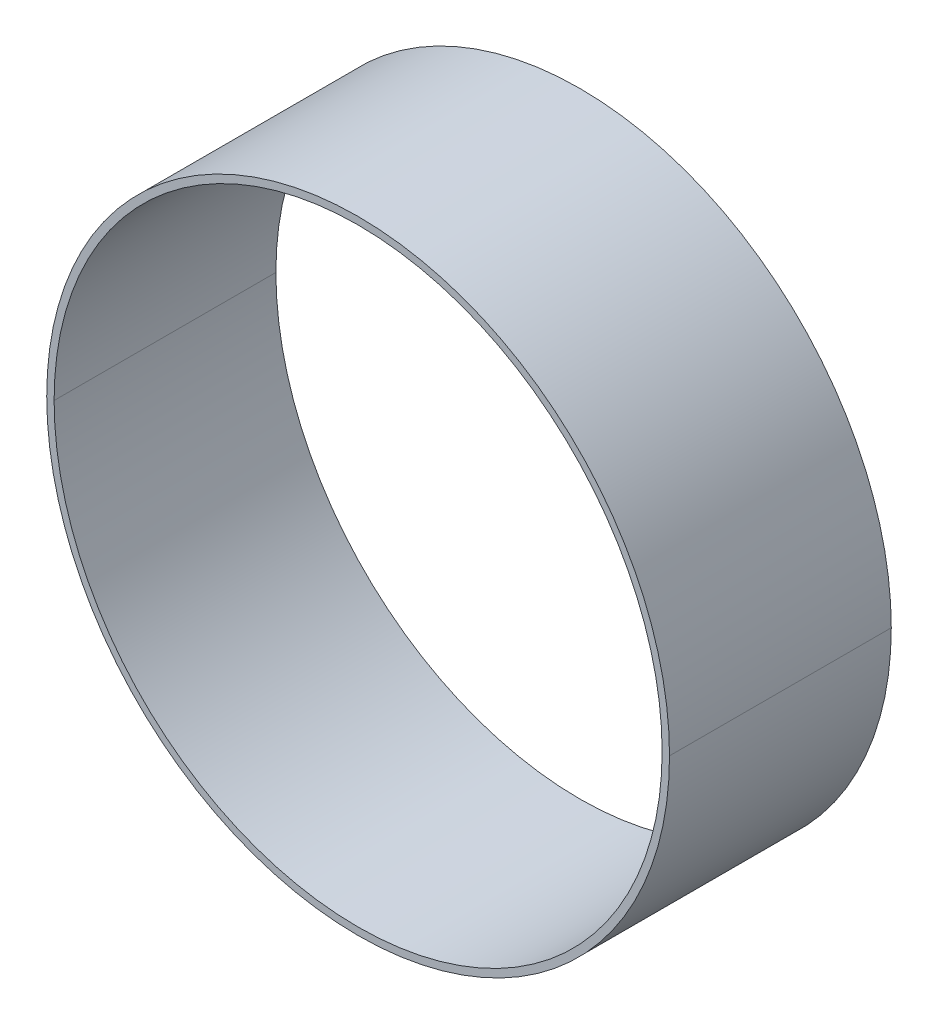
ISO-10303-21;
HEADER;
FILE_DESCRIPTION(('STEP AP214'),'2;1');
FILE_NAME('part.step','',(''),(''),'','','');
FILE_SCHEMA(('AUTOMOTIVE_DESIGN { 1 0 10303 214 1 1 1 1 }'));
ENDSEC;
DATA;
#1=APPLICATION_CONTEXT('core data for automotive mechanical design processes');
#2=APPLICATION_PROTOCOL_DEFINITION('international standard','automotive_design',2000,#1);
#3=PRODUCT_CONTEXT('',#1,'mechanical');
#4=PRODUCT('Part','Part','',(#3));
#5=PRODUCT_RELATED_PRODUCT_CATEGORY('part','',(#4));
#6=PRODUCT_DEFINITION_FORMATION('','',#4);
#7=PRODUCT_DEFINITION_CONTEXT('part definition',#1,'design');
#8=PRODUCT_DEFINITION('design','',#6,#7);
#9=PRODUCT_DEFINITION_SHAPE('','',#8);
#10=(LENGTH_UNIT() NAMED_UNIT(*) SI_UNIT(.MILLI.,.METRE.));
#11=(NAMED_UNIT(*) PLANE_ANGLE_UNIT() SI_UNIT($,.RADIAN.));
#12=(NAMED_UNIT(*) SI_UNIT($,.STERADIAN.) SOLID_ANGLE_UNIT());
#13=UNCERTAINTY_MEASURE_WITH_UNIT(LENGTH_MEASURE(1.E-05),#10,'distance_accuracy_value','');
#14=(GEOMETRIC_REPRESENTATION_CONTEXT(3) GLOBAL_UNCERTAINTY_ASSIGNED_CONTEXT((#13)) GLOBAL_UNIT_ASSIGNED_CONTEXT((#10,
#11,#12)) REPRESENTATION_CONTEXT('',''));
#15=CARTESIAN_POINT('',(0.,0.,0.));
#16=DIRECTION('',(0.,0.,1.));
#17=DIRECTION('',(1.,0.,0.));
#18=AXIS2_PLACEMENT_3D('',#15,#16,#17);
#19=CARTESIAN_POINT('',(0.,0.,6.));
#20=DIRECTION('',(0.,0.,-1.));
#21=DIRECTION('',(-1.,0.,0.));
#22=AXIS2_PLACEMENT_3D('',#19,#20,#21);
#23=CYLINDRICAL_SURFACE('',#22,8.425);
#24=CARTESIAN_POINT('',(0.,0.,6.));
#25=DIRECTION('',(0.,0.,1.));
#26=DIRECTION('',(1.,0.,0.));
#27=AXIS2_PLACEMENT_3D('',#24,#25,#26);
#28=CIRCLE('',#27,8.42500000075);
#29=CARTESIAN_POINT('',(8.425,0.,6.));
#30=VERTEX_POINT('',#29);
#31=CARTESIAN_POINT('',(-8.425,0.,6.));
#32=VERTEX_POINT('',#31);
#33=EDGE_CURVE('E82',#30,#32,#28,.T.);
#34=ORIENTED_EDGE('',*,*,#33,.F.);
#35=DIRECTION('',(0.,0.,-1.));
#36=VECTOR('',#35,1.);
#37=CARTESIAN_POINT('',(8.425,0.,6.));
#38=LINE('',#37,#36);
#39=CARTESIAN_POINT('',(8.425,0.,0.));
#40=VERTEX_POINT('',#39);
#41=EDGE_CURVE('E28',#30,#40,#38,.T.);
#42=ORIENTED_EDGE('',*,*,#41,.T.);
#43=CARTESIAN_POINT('',(0.,0.,0.));
#44=DIRECTION('',(0.,0.,1.));
#45=DIRECTION('',(1.,0.,0.));
#46=AXIS2_PLACEMENT_3D('',#43,#44,#45);
#47=CIRCLE('',#46,8.42500000075);
#48=CARTESIAN_POINT('',(-8.425,0.,0.));
#49=VERTEX_POINT('',#48);
#50=EDGE_CURVE('E103',#40,#49,#47,.T.);
#51=ORIENTED_EDGE('',*,*,#50,.T.);
#52=DIRECTION('',(0.,0.,-1.));
#53=VECTOR('',#52,1.);
#54=CARTESIAN_POINT('',(-8.425,0.,6.));
#55=LINE('',#54,#53);
#56=EDGE_CURVE('E11',#32,#49,#55,.T.);
#57=ORIENTED_EDGE('',*,*,#56,.F.);
#58=EDGE_LOOP('',(#34,#42,#51,#57));
#59=FACE_BOUND('',#58,.T.);
#60=ADVANCED_FACE('F17',(#59),#23,.T.);
#61=CARTESIAN_POINT('',(0.,0.,6.));
#62=DIRECTION('',(0.,0.,-1.));
#63=DIRECTION('',(-1.,0.,0.));
#64=AXIS2_PLACEMENT_3D('',#61,#62,#63);
#65=CYLINDRICAL_SURFACE('',#64,8.425);
#66=ORIENTED_EDGE('',*,*,#41,.F.);
#67=CARTESIAN_POINT('',(0.,0.,6.));
#68=DIRECTION('',(0.,0.,1.));
#69=DIRECTION('',(1.,0.,0.));
#70=AXIS2_PLACEMENT_3D('',#67,#68,#69);
#71=CIRCLE('',#70,8.42500000075);
#72=EDGE_CURVE('E21',#32,#30,#71,.T.);
#73=ORIENTED_EDGE('',*,*,#72,.F.);
#74=ORIENTED_EDGE('',*,*,#56,.T.);
#75=CARTESIAN_POINT('',(0.,0.,0.));
#76=DIRECTION('',(0.,0.,1.));
#77=DIRECTION('',(1.,0.,0.));
#78=AXIS2_PLACEMENT_3D('',#75,#76,#77);
#79=CIRCLE('',#78,8.42500000075);
#80=EDGE_CURVE('E101',#49,#40,#79,.T.);
#81=ORIENTED_EDGE('',*,*,#80,.T.);
#82=EDGE_LOOP('',(#66,#73,#74,#81));
#83=FACE_BOUND('',#82,.T.);
#84=ADVANCED_FACE('F123',(#83),#65,.T.);
#85=CARTESIAN_POINT('',(0.,0.,0.));
#86=DIRECTION('',(0.,0.,1.));
#87=DIRECTION('',(1.,0.,0.));
#88=AXIS2_PLACEMENT_3D('',#85,#86,#87);
#89=PLANE('',#88);
#90=CARTESIAN_POINT('',(0.,0.,0.));
#91=DIRECTION('',(0.,0.,1.));
#92=DIRECTION('',(1.,0.,0.));
#93=AXIS2_PLACEMENT_3D('',#90,#91,#92);
#94=CIRCLE('',#93,8.225);
#95=CARTESIAN_POINT('',(-8.225,0.,0.));
#96=VERTEX_POINT('',#95);
#97=CARTESIAN_POINT('',(8.225,0.,0.));
#98=VERTEX_POINT('',#97);
#99=EDGE_CURVE('E87',#96,#98,#94,.T.);
#100=ORIENTED_EDGE('',*,*,#99,.T.);
#101=CARTESIAN_POINT('',(0.,0.,0.));
#102=DIRECTION('',(0.,0.,1.));
#103=DIRECTION('',(1.,0.,0.));
#104=AXIS2_PLACEMENT_3D('',#101,#102,#103);
#105=CIRCLE('',#104,8.225);
#106=EDGE_CURVE('E55',#98,#96,#105,.T.);
#107=ORIENTED_EDGE('',*,*,#106,.T.);
#108=EDGE_LOOP('',(#100,#107));
#109=FACE_BOUND('',#108,.T.);
#110=ORIENTED_EDGE('',*,*,#80,.F.);
#111=ORIENTED_EDGE('',*,*,#50,.F.);
#112=EDGE_LOOP('',(#110,#111));
#113=FACE_BOUND('',#112,.T.);
#114=ADVANCED_FACE('F130',(#109,#113),#89,.F.);
#115=CARTESIAN_POINT('',(0.,0.,6.));
#116=DIRECTION('',(0.,0.,-1.));
#117=DIRECTION('',(-1.,0.,0.));
#118=AXIS2_PLACEMENT_3D('',#115,#116,#117);
#119=CYLINDRICAL_SURFACE('',#118,8.225);
#120=DIRECTION('',(0.,0.,-1.));
#121=VECTOR('',#120,1.);
#122=CARTESIAN_POINT('',(8.225,0.,6.));
#123=LINE('',#122,#121);
#124=CARTESIAN_POINT('',(8.225,0.,6.));
#125=VERTEX_POINT('',#124);
#126=EDGE_CURVE('E77',#125,#98,#123,.T.);
#127=ORIENTED_EDGE('',*,*,#126,.F.);
#128=CARTESIAN_POINT('',(0.,0.,6.));
#129=DIRECTION('',(0.,0.,1.));
#130=DIRECTION('',(1.,0.,0.));
#131=AXIS2_PLACEMENT_3D('',#128,#129,#130);
#132=CIRCLE('',#131,8.22499999963);
#133=CARTESIAN_POINT('',(-8.225,0.,6.));
#134=VERTEX_POINT('',#133);
#135=EDGE_CURVE('E72',#125,#134,#132,.T.);
#136=ORIENTED_EDGE('',*,*,#135,.T.);
#137=DIRECTION('',(0.,0.,-1.));
#138=VECTOR('',#137,1.);
#139=CARTESIAN_POINT('',(-8.225,0.,6.));
#140=LINE('',#139,#138);
#141=EDGE_CURVE('E74',#134,#96,#140,.T.);
#142=ORIENTED_EDGE('',*,*,#141,.T.);
#143=ORIENTED_EDGE('',*,*,#106,.F.);
#144=EDGE_LOOP('',(#127,#136,#142,#143));
#145=FACE_BOUND('',#144,.T.);
#146=ADVANCED_FACE('F19',(#145),#119,.F.);
#147=CARTESIAN_POINT('',(0.,0.,6.));
#148=DIRECTION('',(0.,0.,1.));
#149=DIRECTION('',(1.,0.,0.));
#150=AXIS2_PLACEMENT_3D('',#147,#148,#149);
#151=PLANE('',#150);
#152=CARTESIAN_POINT('',(0.,0.,6.));
#153=DIRECTION('',(0.,0.,1.));
#154=DIRECTION('',(1.,0.,0.));
#155=AXIS2_PLACEMENT_3D('',#152,#153,#154);
#156=CIRCLE('',#155,8.225);
#157=EDGE_CURVE('E86',#134,#125,#156,.T.);
#158=ORIENTED_EDGE('',*,*,#157,.F.);
#159=ORIENTED_EDGE('',*,*,#135,.F.);
#160=EDGE_LOOP('',(#158,#159));
#161=FACE_BOUND('',#160,.T.);
#162=ORIENTED_EDGE('',*,*,#72,.T.);
#163=ORIENTED_EDGE('',*,*,#33,.T.);
#164=EDGE_LOOP('',(#162,#163));
#165=FACE_BOUND('',#164,.T.);
#166=ADVANCED_FACE('F90',(#161,#165),#151,.T.);
#167=CARTESIAN_POINT('',(0.,0.,6.));
#168=DIRECTION('',(0.,0.,-1.));
#169=DIRECTION('',(-1.,0.,0.));
#170=AXIS2_PLACEMENT_3D('',#167,#168,#169);
#171=CYLINDRICAL_SURFACE('',#170,8.225);
#172=ORIENTED_EDGE('',*,*,#157,.T.);
#173=ORIENTED_EDGE('',*,*,#126,.T.);
#174=ORIENTED_EDGE('',*,*,#99,.F.);
#175=ORIENTED_EDGE('',*,*,#141,.F.);
#176=EDGE_LOOP('',(#172,#173,#174,#175));
#177=FACE_BOUND('',#176,.T.);
#178=ADVANCED_FACE('F85',(#177),#171,.F.);
#179=CLOSED_SHELL('',(#60,#84,#114,#146,#166,#178));
#180=MANIFOLD_SOLID_BREP('B1',#179);
#181=ADVANCED_BREP_SHAPE_REPRESENTATION('',(#18,#180),#14);
#182=SHAPE_DEFINITION_REPRESENTATION(#9,#181);
ENDSEC;
END-ISO-10303-21;
